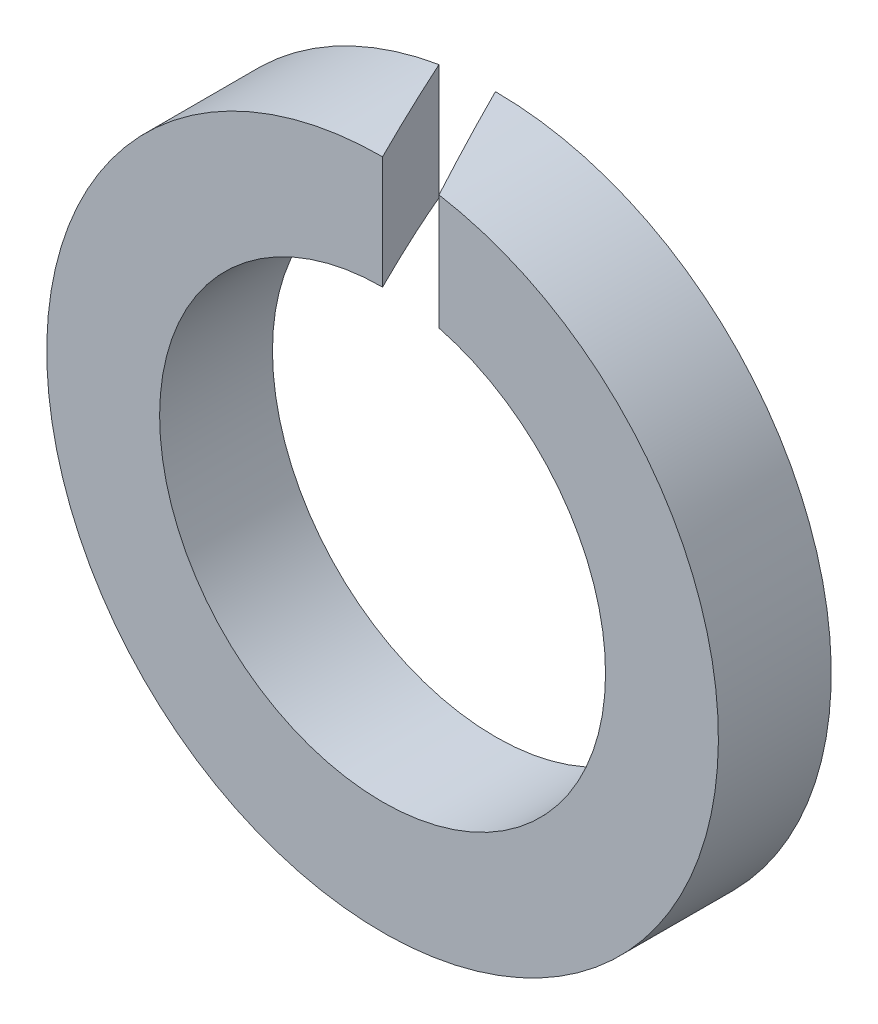
ISO-10303-21;
HEADER;
FILE_DESCRIPTION(('STEP AP214'),'2;1');
FILE_NAME('part.step','',(''),(''),'','','');
FILE_SCHEMA(('AUTOMOTIVE_DESIGN { 1 0 10303 214 1 1 1 1 }'));
ENDSEC;
DATA;
#1=APPLICATION_CONTEXT('core data for automotive mechanical design processes');
#2=APPLICATION_PROTOCOL_DEFINITION('international standard','automotive_design',2000,#1);
#3=PRODUCT_CONTEXT('',#1,'mechanical');
#4=PRODUCT('Part','Part','',(#3));
#5=PRODUCT_RELATED_PRODUCT_CATEGORY('part','',(#4));
#6=PRODUCT_DEFINITION_FORMATION('','',#4);
#7=PRODUCT_DEFINITION_CONTEXT('part definition',#1,'design');
#8=PRODUCT_DEFINITION('design','',#6,#7);
#9=PRODUCT_DEFINITION_SHAPE('','',#8);
#10=(LENGTH_UNIT() NAMED_UNIT(*) SI_UNIT(.MILLI.,.METRE.));
#11=(NAMED_UNIT(*) PLANE_ANGLE_UNIT() SI_UNIT($,.RADIAN.));
#12=(NAMED_UNIT(*) SI_UNIT($,.STERADIAN.) SOLID_ANGLE_UNIT());
#13=UNCERTAINTY_MEASURE_WITH_UNIT(LENGTH_MEASURE(1.E-05),#10,'distance_accuracy_value','');
#14=(GEOMETRIC_REPRESENTATION_CONTEXT(3) GLOBAL_UNCERTAINTY_ASSIGNED_CONTEXT((#13)) GLOBAL_UNIT_ASSIGNED_CONTEXT((#10,
#11,#12)) REPRESENTATION_CONTEXT('',''));
#15=CARTESIAN_POINT('',(0.,0.,0.));
#16=DIRECTION('',(0.,0.,1.));
#17=DIRECTION('',(1.,0.,0.));
#18=AXIS2_PLACEMENT_3D('',#15,#16,#17);
#19=CARTESIAN_POINT('',(0.,0.,4.09999999999999));
#20=DIRECTION('',(0.,0.,1.));
#21=DIRECTION('',(1.00000000000001,0.,0.));
#22=AXIS2_PLACEMENT_3D('',#19,#20,#21);
#23=PLANE('',#22);
#24=CARTESIAN_POINT('',(0.,0.,4.09999999999999));
#25=DIRECTION('',(0.,0.,1.));
#26=DIRECTION('',(1.00000000000001,0.,0.));
#27=AXIS2_PLACEMENT_3D('',#24,#25,#26);
#28=CIRCLE('',#27,8.1);
#29=CARTESIAN_POINT('',(2.04999999999999,7.83629376682626,4.09999999999999));
#30=VERTEX_POINT('',#29);
#31=CARTESIAN_POINT('',(0.,8.10000000000004,4.09999999999999));
#32=VERTEX_POINT('',#31);
#33=EDGE_CURVE('E66',#30,#32,#28,.F.);
#34=ORIENTED_EDGE('',*,*,#33,.T.);
#35=DIRECTION('',(0.,1.,0.));
#36=VECTOR('',#35,1.);
#37=CARTESIAN_POINT('',(0.,0.,4.09999999999999));
#38=LINE('',#37,#36);
#39=CARTESIAN_POINT('',(0.,12.2000000000001,4.09999999999999));
#40=VERTEX_POINT('',#39);
#41=EDGE_CURVE('E58',#32,#40,#38,.T.);
#42=ORIENTED_EDGE('',*,*,#41,.T.);
#43=CARTESIAN_POINT('',(0.,0.,4.09999999999999));
#44=DIRECTION('',(0.,0.,1.));
#45=DIRECTION('',(1.00000000000001,0.,0.));
#46=AXIS2_PLACEMENT_3D('',#43,#44,#45);
#47=CIRCLE('',#46,12.2);
#48=CARTESIAN_POINT('',(2.04999999999992,12.0265331662954,4.09999999999999));
#49=VERTEX_POINT('',#48);
#50=EDGE_CURVE('E78',#49,#40,#47,.F.);
#51=ORIENTED_EDGE('',*,*,#50,.F.);
#52=DIRECTION('',(0.,1.,0.));
#53=VECTOR('',#52,1.);
#54=CARTESIAN_POINT('',(2.04999999999999,1.38777878078145E-13,4.09999999999999));
#55=LINE('',#54,#53);
#56=EDGE_CURVE('E71',#49,#30,#55,.F.);
#57=ORIENTED_EDGE('',*,*,#56,.T.);
#58=EDGE_LOOP('',(#34,#42,#51,#57));
#59=FACE_BOUND('',#58,.T.);
#60=ADVANCED_FACE('F16',(#59),#23,.T.);
#61=CARTESIAN_POINT('',(-2.05000000000007,1.31838984174237E-13,0.));
#62=DIRECTION('',(-0.894427190999922,0.,0.447213595499958));
#63=DIRECTION('',(0.447213595499961,0.,0.894427190999916));
#64=AXIS2_PLACEMENT_3D('',#61,#62,#63);
#65=PLANE('',#64);
#66=CARTESIAN_POINT('',(0.,0.,4.09999999999999));
#67=DIRECTION('',(-0.894427190999922,0.,0.447213595499958));
#68=DIRECTION('',(0.447213595499961,0.,0.894427190999916));
#69=AXIS2_PLACEMENT_3D('',#66,#67,#68);
#70=ELLIPSE('',#69,27.2800293254974,12.2);
#71=CARTESIAN_POINT('',(-2.05000000000009,12.0265331662954,0.));
#72=VERTEX_POINT('',#71);
#73=EDGE_CURVE('E19',#40,#72,#70,.T.);
#74=ORIENTED_EDGE('',*,*,#73,.F.);
#75=ORIENTED_EDGE('',*,*,#41,.F.);
#76=CARTESIAN_POINT('',(0.,0.,4.09999999999999));
#77=DIRECTION('',(-0.894427190999922,0.,0.447213595499958));
#78=DIRECTION('',(0.447213595499961,0.,0.894427190999916));
#79=AXIS2_PLACEMENT_3D('',#76,#77,#78);
#80=ELLIPSE('',#79,18.1121506177483,8.1);
#81=CARTESIAN_POINT('',(-2.05000000000009,7.83629376682649,0.));
#82=VERTEX_POINT('',#81);
#83=EDGE_CURVE('E61',#32,#82,#80,.T.);
#84=ORIENTED_EDGE('',*,*,#83,.T.);
#85=DIRECTION('',(0.,1.,0.));
#86=VECTOR('',#85,1.);
#87=CARTESIAN_POINT('',(-2.05000000000007,1.31838984174237E-13,0.));
#88=LINE('',#87,#86);
#89=EDGE_CURVE('E68',#82,#72,#88,.T.);
#90=ORIENTED_EDGE('',*,*,#89,.T.);
#91=EDGE_LOOP('',(#74,#75,#84,#90));
#92=FACE_BOUND('',#91,.T.);
#93=ADVANCED_FACE('F59',(#92),#65,.F.);
#94=CARTESIAN_POINT('',(0.,0.,0.));
#95=DIRECTION('',(0.,0.,1.));
#96=DIRECTION('',(1.00000000000001,0.,0.));
#97=AXIS2_PLACEMENT_3D('',#94,#95,#96);
#98=CYLINDRICAL_SURFACE('',#97,12.2);
#99=CARTESIAN_POINT('',(0.,0.,0.));
#100=DIRECTION('',(0.,0.,1.));
#101=DIRECTION('',(1.00000000000001,0.,0.));
#102=AXIS2_PLACEMENT_3D('',#99,#100,#101);
#103=CIRCLE('',#102,12.2);
#104=CARTESIAN_POINT('',(0.,12.2000000000001,0.));
#105=VERTEX_POINT('',#104);
#106=EDGE_CURVE('E88',#72,#105,#103,.T.);
#107=ORIENTED_EDGE('',*,*,#106,.T.);
#108=CARTESIAN_POINT('',(0.,0.,0.));
#109=DIRECTION('',(0.894427190999922,0.,-0.447213595499958));
#110=DIRECTION('',(0.447213595499961,0.,0.894427190999916));
#111=AXIS2_PLACEMENT_3D('',#108,#109,#110);
#112=ELLIPSE('',#111,27.2800293254974,12.2);
#113=EDGE_CURVE('E76',#105,#49,#112,.T.);
#114=ORIENTED_EDGE('',*,*,#113,.T.);
#115=ORIENTED_EDGE('',*,*,#50,.T.);
#116=ORIENTED_EDGE('',*,*,#73,.T.);
#117=EDGE_LOOP('',(#107,#114,#115,#116));
#118=FACE_BOUND('',#117,.T.);
#119=ADVANCED_FACE('F79',(#118),#98,.T.);
#120=CARTESIAN_POINT('',(2.04999999999999,1.38777878078145E-13,4.09999999999999));
#121=DIRECTION('',(0.894427190999922,0.,-0.447213595499958));
#122=DIRECTION('',(-0.447213595499961,0.,-0.894427190999916));
#123=AXIS2_PLACEMENT_3D('',#120,#121,#122);
#124=PLANE('',#123);
#125=CARTESIAN_POINT('',(0.,0.,0.));
#126=DIRECTION('',(0.894427190999922,0.,-0.447213595499958));
#127=DIRECTION('',(0.447213595499961,0.,0.894427190999916));
#128=AXIS2_PLACEMENT_3D('',#125,#126,#127);
#129=ELLIPSE('',#128,18.1121506177483,8.1);
#130=CARTESIAN_POINT('',(0.,8.10000000000004,0.));
#131=VERTEX_POINT('',#130);
#132=EDGE_CURVE('E33',#131,#30,#129,.T.);
#133=ORIENTED_EDGE('',*,*,#132,.T.);
#134=ORIENTED_EDGE('',*,*,#56,.F.);
#135=ORIENTED_EDGE('',*,*,#113,.F.);
#136=DIRECTION('',(0.,1.,0.));
#137=VECTOR('',#136,1.);
#138=CARTESIAN_POINT('',(0.,0.,0.));
#139=LINE('',#138,#137);
#140=EDGE_CURVE('E25',#105,#131,#139,.F.);
#141=ORIENTED_EDGE('',*,*,#140,.T.);
#142=EDGE_LOOP('',(#133,#134,#135,#141));
#143=FACE_BOUND('',#142,.T.);
#144=ADVANCED_FACE('F82',(#143),#124,.F.);
#145=CARTESIAN_POINT('',(0.,0.,0.));
#146=DIRECTION('',(0.,0.,1.));
#147=DIRECTION('',(1.00000000000001,0.,0.));
#148=AXIS2_PLACEMENT_3D('',#145,#146,#147);
#149=CYLINDRICAL_SURFACE('',#148,8.1);
#150=CARTESIAN_POINT('',(0.,0.,0.));
#151=DIRECTION('',(0.,0.,1.));
#152=DIRECTION('',(1.00000000000001,0.,0.));
#153=AXIS2_PLACEMENT_3D('',#150,#151,#152);
#154=CIRCLE('',#153,8.1);
#155=EDGE_CURVE('E11',#131,#82,#154,.F.);
#156=ORIENTED_EDGE('',*,*,#155,.T.);
#157=ORIENTED_EDGE('',*,*,#83,.F.);
#158=ORIENTED_EDGE('',*,*,#33,.F.);
#159=ORIENTED_EDGE('',*,*,#132,.F.);
#160=EDGE_LOOP('',(#156,#157,#158,#159));
#161=FACE_BOUND('',#160,.T.);
#162=ADVANCED_FACE('F65',(#161),#149,.F.);
#163=CARTESIAN_POINT('',(0.,0.,0.));
#164=DIRECTION('',(0.,0.,1.));
#165=DIRECTION('',(1.00000000000001,0.,0.));
#166=AXIS2_PLACEMENT_3D('',#163,#164,#165);
#167=PLANE('',#166);
#168=ORIENTED_EDGE('',*,*,#155,.F.);
#169=ORIENTED_EDGE('',*,*,#140,.F.);
#170=ORIENTED_EDGE('',*,*,#106,.F.);
#171=ORIENTED_EDGE('',*,*,#89,.F.);
#172=EDGE_LOOP('',(#168,#169,#170,#171));
#173=FACE_BOUND('',#172,.T.);
#174=ADVANCED_FACE('F90',(#173),#167,.F.);
#175=CLOSED_SHELL('',(#60,#93,#119,#144,#162,#174));
#176=MANIFOLD_SOLID_BREP('B1',#175);
#177=ADVANCED_BREP_SHAPE_REPRESENTATION('',(#18,#176),#14);
#178=SHAPE_DEFINITION_REPRESENTATION(#9,#177);
ENDSEC;
END-ISO-10303-21;
